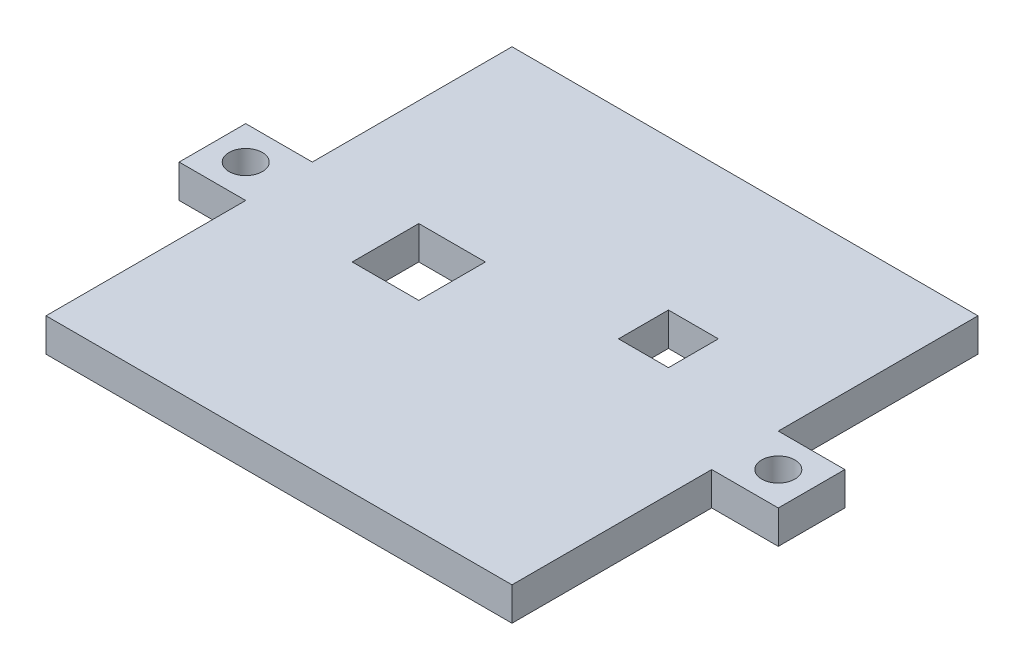
ISO-10303-21;
HEADER;
FILE_DESCRIPTION(('STEP AP214'),'2;1');
FILE_NAME('part.step','',(''),(''),'','','');
FILE_SCHEMA(('AUTOMOTIVE_DESIGN { 1 0 10303 214 1 1 1 1 }'));
ENDSEC;
DATA;
#1=APPLICATION_CONTEXT('core data for automotive mechanical design processes');
#2=APPLICATION_PROTOCOL_DEFINITION('international standard','automotive_design',2000,#1);
#3=PRODUCT_CONTEXT('',#1,'mechanical');
#4=PRODUCT('Part','Part','',(#3));
#5=PRODUCT_RELATED_PRODUCT_CATEGORY('part','',(#4));
#6=PRODUCT_DEFINITION_FORMATION('','',#4);
#7=PRODUCT_DEFINITION_CONTEXT('part definition',#1,'design');
#8=PRODUCT_DEFINITION('design','',#6,#7);
#9=PRODUCT_DEFINITION_SHAPE('','',#8);
#10=(LENGTH_UNIT() NAMED_UNIT(*) SI_UNIT(.MILLI.,.METRE.));
#11=(NAMED_UNIT(*) PLANE_ANGLE_UNIT() SI_UNIT($,.RADIAN.));
#12=(NAMED_UNIT(*) SI_UNIT($,.STERADIAN.) SOLID_ANGLE_UNIT());
#13=UNCERTAINTY_MEASURE_WITH_UNIT(LENGTH_MEASURE(1.E-05),#10,'distance_accuracy_value','');
#14=(GEOMETRIC_REPRESENTATION_CONTEXT(3) GLOBAL_UNCERTAINTY_ASSIGNED_CONTEXT((#13)) GLOBAL_UNIT_ASSIGNED_CONTEXT((#10,
#11,#12)) REPRESENTATION_CONTEXT('',''));
#15=CARTESIAN_POINT('',(0.,0.,0.));
#16=DIRECTION('',(0.,0.,1.));
#17=DIRECTION('',(1.,0.,0.));
#18=AXIS2_PLACEMENT_3D('',#15,#16,#17);
#19=CARTESIAN_POINT('',(-6.35,6.35,6.35));
#20=DIRECTION('',(1.,0.,0.));
#21=DIRECTION('',(0.,0.,-1.));
#22=AXIS2_PLACEMENT_3D('',#19,#20,#21);
#23=PLANE('',#22);
#24=DIRECTION('',(0.,1.,0.));
#25=VECTOR('',#24,1.);
#26=CARTESIAN_POINT('',(-6.34999999999999,0.,-31.75));
#27=LINE('',#26,#25);
#28=CARTESIAN_POINT('',(-6.34999999999999,0.,-31.75));
#29=VERTEX_POINT('',#28);
#30=CARTESIAN_POINT('',(-6.34999999999999,6.35,-31.75));
#31=VERTEX_POINT('',#30);
#32=EDGE_CURVE('E272',#29,#31,#27,.T.);
#33=ORIENTED_EDGE('',*,*,#32,.F.);
#34=DIRECTION('',(0.,0.,1.));
#35=VECTOR('',#34,1.);
#36=CARTESIAN_POINT('',(-6.35,0.,6.35));
#37=LINE('',#36,#35);
#38=CARTESIAN_POINT('',(-6.35,0.,6.35));
#39=VERTEX_POINT('',#38);
#40=EDGE_CURVE('E296',#29,#39,#37,.T.);
#41=ORIENTED_EDGE('',*,*,#40,.T.);
#42=DIRECTION('',(0.,-1.,0.));
#43=VECTOR('',#42,1.);
#44=CARTESIAN_POINT('',(-6.35,6.35,6.35));
#45=LINE('',#44,#43);
#46=CARTESIAN_POINT('',(-6.35,6.35,6.35));
#47=VERTEX_POINT('',#46);
#48=EDGE_CURVE('E11',#47,#39,#45,.T.);
#49=ORIENTED_EDGE('',*,*,#48,.F.);
#50=DIRECTION('',(0.,0.,1.));
#51=VECTOR('',#50,1.);
#52=CARTESIAN_POINT('',(-6.35,6.35,6.35));
#53=LINE('',#52,#51);
#54=EDGE_CURVE('E307',#31,#47,#53,.T.);
#55=ORIENTED_EDGE('',*,*,#54,.F.);
#56=EDGE_LOOP('',(#33,#41,#49,#55));
#57=FACE_BOUND('',#56,.T.);
#58=ADVANCED_FACE('F33',(#57),#23,.F.);
#59=CARTESIAN_POINT('',(82.55,6.35,6.35));
#60=DIRECTION('',(-1.,0.,0.));
#61=DIRECTION('',(0.,0.,1.));
#62=AXIS2_PLACEMENT_3D('',#59,#60,#61);
#63=PLANE('',#62);
#64=DIRECTION('',(0.,1.,0.));
#65=VECTOR('',#64,1.);
#66=CARTESIAN_POINT('',(82.55,0.,-44.45));
#67=LINE('',#66,#65);
#68=CARTESIAN_POINT('',(82.55,0.,-44.45));
#69=VERTEX_POINT('',#68);
#70=CARTESIAN_POINT('',(82.55,6.35,-44.45));
#71=VERTEX_POINT('',#70);
#72=EDGE_CURVE('E294',#69,#71,#67,.T.);
#73=ORIENTED_EDGE('',*,*,#72,.F.);
#74=DIRECTION('',(0.,0.,-1.));
#75=VECTOR('',#74,1.);
#76=CARTESIAN_POINT('',(82.55,0.,6.35));
#77=LINE('',#76,#75);
#78=CARTESIAN_POINT('',(82.55,0.,-82.55));
#79=VERTEX_POINT('',#78);
#80=EDGE_CURVE('E321',#69,#79,#77,.T.);
#81=ORIENTED_EDGE('',*,*,#80,.T.);
#82=DIRECTION('',(0.,-1.,0.));
#83=VECTOR('',#82,1.);
#84=CARTESIAN_POINT('',(82.55,6.35,-82.55));
#85=LINE('',#84,#83);
#86=CARTESIAN_POINT('',(82.55,6.35,-82.55));
#87=VERTEX_POINT('',#86);
#88=EDGE_CURVE('E329',#87,#79,#85,.T.);
#89=ORIENTED_EDGE('',*,*,#88,.F.);
#90=DIRECTION('',(0.,0.,-1.));
#91=VECTOR('',#90,1.);
#92=CARTESIAN_POINT('',(82.55,6.35,6.35));
#93=LINE('',#92,#91);
#94=EDGE_CURVE('E309',#71,#87,#93,.T.);
#95=ORIENTED_EDGE('',*,*,#94,.F.);
#96=EDGE_LOOP('',(#73,#81,#89,#95));
#97=FACE_BOUND('',#96,.T.);
#98=ADVANCED_FACE('F377',(#97),#63,.F.);
#99=CARTESIAN_POINT('',(-6.35,0.,-82.55));
#100=VERTEX_POINT('',#99);
#101=CARTESIAN_POINT('',(-6.34999999999999,0.,-44.45));
#102=VERTEX_POINT('',#101);
#103=EDGE_CURVE('E316',#100,#102,#37,.T.);
#104=ORIENTED_EDGE('',*,*,#103,.T.);
#105=DIRECTION('',(0.,1.,0.));
#106=VECTOR('',#105,1.);
#107=CARTESIAN_POINT('',(-6.34999999999999,0.,-44.45));
#108=LINE('',#107,#106);
#109=CARTESIAN_POINT('',(-6.35,6.35,-44.45));
#110=VERTEX_POINT('',#109);
#111=EDGE_CURVE('E268',#102,#110,#108,.T.);
#112=ORIENTED_EDGE('',*,*,#111,.T.);
#113=CARTESIAN_POINT('',(-6.35,6.35,-82.55));
#114=VERTEX_POINT('',#113);
#115=EDGE_CURVE('E303',#114,#110,#53,.T.);
#116=ORIENTED_EDGE('',*,*,#115,.F.);
#117=DIRECTION('',(0.,-1.,0.));
#118=VECTOR('',#117,1.);
#119=CARTESIAN_POINT('',(-6.35,6.35,-82.55));
#120=LINE('',#119,#118);
#121=EDGE_CURVE('E315',#114,#100,#120,.T.);
#122=ORIENTED_EDGE('',*,*,#121,.T.);
#123=EDGE_LOOP('',(#104,#112,#116,#122));
#124=FACE_BOUND('',#123,.T.);
#125=ADVANCED_FACE('F35',(#124),#23,.F.);
#126=CARTESIAN_POINT('',(-6.35,6.35,6.35));
#127=DIRECTION('',(0.,0.,-1.));
#128=DIRECTION('',(-1.,0.,0.));
#129=AXIS2_PLACEMENT_3D('',#126,#127,#128);
#130=PLANE('',#129);
#131=DIRECTION('',(1.,0.,0.));
#132=VECTOR('',#131,1.);
#133=CARTESIAN_POINT('',(-6.35,0.,6.35));
#134=LINE('',#133,#132);
#135=CARTESIAN_POINT('',(82.55,0.,6.35));
#136=VERTEX_POINT('',#135);
#137=EDGE_CURVE('E319',#39,#136,#134,.T.);
#138=ORIENTED_EDGE('',*,*,#137,.T.);
#139=DIRECTION('',(0.,-1.,0.));
#140=VECTOR('',#139,1.);
#141=CARTESIAN_POINT('',(82.55,6.35,6.35));
#142=LINE('',#141,#140);
#143=CARTESIAN_POINT('',(82.55,6.35,6.35));
#144=VERTEX_POINT('',#143);
#145=EDGE_CURVE('E41',#144,#136,#142,.T.);
#146=ORIENTED_EDGE('',*,*,#145,.F.);
#147=DIRECTION('',(1.,0.,0.));
#148=VECTOR('',#147,1.);
#149=CARTESIAN_POINT('',(-6.35,6.35,6.35));
#150=LINE('',#149,#148);
#151=EDGE_CURVE('E306',#47,#144,#150,.T.);
#152=ORIENTED_EDGE('',*,*,#151,.F.);
#153=ORIENTED_EDGE('',*,*,#48,.T.);
#154=EDGE_LOOP('',(#138,#146,#152,#153));
#155=FACE_BOUND('',#154,.T.);
#156=ADVANCED_FACE('F353',(#155),#130,.F.);
#157=CARTESIAN_POINT('',(82.55,0.,-31.75));
#158=VERTEX_POINT('',#157);
#159=EDGE_CURVE('E322',#136,#158,#77,.T.);
#160=ORIENTED_EDGE('',*,*,#159,.T.);
#161=DIRECTION('',(0.,1.,0.));
#162=VECTOR('',#161,1.);
#163=CARTESIAN_POINT('',(82.55,0.,-31.75));
#164=LINE('',#163,#162);
#165=CARTESIAN_POINT('',(82.55,6.35,-31.75));
#166=VERTEX_POINT('',#165);
#167=EDGE_CURVE('E286',#158,#166,#164,.T.);
#168=ORIENTED_EDGE('',*,*,#167,.T.);
#169=EDGE_CURVE('E310',#144,#166,#93,.T.);
#170=ORIENTED_EDGE('',*,*,#169,.F.);
#171=ORIENTED_EDGE('',*,*,#145,.T.);
#172=EDGE_LOOP('',(#160,#168,#170,#171));
#173=FACE_BOUND('',#172,.T.);
#174=ADVANCED_FACE('F336',(#173),#63,.F.);
#175=CARTESIAN_POINT('',(-6.35,6.35,-82.55));
#176=DIRECTION('',(0.,0.,1.));
#177=DIRECTION('',(1.,0.,0.));
#178=AXIS2_PLACEMENT_3D('',#175,#176,#177);
#179=PLANE('',#178);
#180=DIRECTION('',(-1.,0.,0.));
#181=VECTOR('',#180,1.);
#182=CARTESIAN_POINT('',(-6.35,0.,-82.55));
#183=LINE('',#182,#181);
#184=EDGE_CURVE('E325',#79,#100,#183,.T.);
#185=ORIENTED_EDGE('',*,*,#184,.T.);
#186=ORIENTED_EDGE('',*,*,#121,.F.);
#187=DIRECTION('',(-1.,0.,0.));
#188=VECTOR('',#187,1.);
#189=CARTESIAN_POINT('',(-6.35,6.35,-82.55));
#190=LINE('',#189,#188);
#191=EDGE_CURVE('E313',#87,#114,#190,.T.);
#192=ORIENTED_EDGE('',*,*,#191,.F.);
#193=ORIENTED_EDGE('',*,*,#88,.T.);
#194=EDGE_LOOP('',(#185,#186,#192,#193));
#195=FACE_BOUND('',#194,.T.);
#196=ADVANCED_FACE('F372',(#195),#179,.F.);
#197=CARTESIAN_POINT('',(0.,6.35,0.));
#198=DIRECTION('',(0.,-1.,0.));
#199=DIRECTION('',(0.,0.,-1.));
#200=AXIS2_PLACEMENT_3D('',#197,#198,#199);
#201=PLANE('',#200);
#202=DIRECTION('',(1.,0.,0.));
#203=VECTOR('',#202,1.);
#204=CARTESIAN_POINT('',(52.07,6.35,-44.45));
#205=LINE('',#204,#203);
#206=CARTESIAN_POINT('',(52.07,6.35,-44.45));
#207=VERTEX_POINT('',#206);
#208=CARTESIAN_POINT('',(61.595,6.35,-44.45));
#209=VERTEX_POINT('',#208);
#210=EDGE_CURVE('E197',#207,#209,#205,.T.);
#211=ORIENTED_EDGE('',*,*,#210,.F.);
#212=DIRECTION('',(0.,0.,1.));
#213=VECTOR('',#212,1.);
#214=CARTESIAN_POINT('',(52.07,6.35,-53.975));
#215=LINE('',#214,#213);
#216=CARTESIAN_POINT('',(52.07,6.35,-53.975));
#217=VERTEX_POINT('',#216);
#218=EDGE_CURVE('E48',#217,#207,#215,.T.);
#219=ORIENTED_EDGE('',*,*,#218,.F.);
#220=DIRECTION('',(-1.,0.,0.));
#221=VECTOR('',#220,1.);
#222=CARTESIAN_POINT('',(52.07,6.35,-53.975));
#223=LINE('',#222,#221);
#224=CARTESIAN_POINT('',(61.595,6.35,-53.975));
#225=VERTEX_POINT('',#224);
#226=EDGE_CURVE('E188',#225,#217,#223,.T.);
#227=ORIENTED_EDGE('',*,*,#226,.F.);
#228=DIRECTION('',(0.,0.,-1.));
#229=VECTOR('',#228,1.);
#230=CARTESIAN_POINT('',(61.595,6.35,-53.975));
#231=LINE('',#230,#229);
#232=EDGE_CURVE('E191',#209,#225,#231,.T.);
#233=ORIENTED_EDGE('',*,*,#232,.F.);
#234=EDGE_LOOP('',(#211,#219,#227,#233));
#235=FACE_BOUND('',#234,.T.);
#236=DIRECTION('',(1.,0.,0.));
#237=VECTOR('',#236,1.);
#238=CARTESIAN_POINT('',(13.97,6.35,-31.75));
#239=LINE('',#238,#237);
#240=CARTESIAN_POINT('',(13.97,6.35,-31.75));
#241=VERTEX_POINT('',#240);
#242=CARTESIAN_POINT('',(26.67,6.35,-31.75));
#243=VERTEX_POINT('',#242);
#244=EDGE_CURVE('E222',#241,#243,#239,.T.);
#245=ORIENTED_EDGE('',*,*,#244,.F.);
#246=DIRECTION('',(0.,0.,1.));
#247=VECTOR('',#246,1.);
#248=CARTESIAN_POINT('',(13.97,6.35,-44.45));
#249=LINE('',#248,#247);
#250=CARTESIAN_POINT('',(13.97,6.35,-44.45));
#251=VERTEX_POINT('',#250);
#252=EDGE_CURVE('E203',#251,#241,#249,.T.);
#253=ORIENTED_EDGE('',*,*,#252,.F.);
#254=DIRECTION('',(-1.,0.,0.));
#255=VECTOR('',#254,1.);
#256=CARTESIAN_POINT('',(13.97,6.35,-44.45));
#257=LINE('',#256,#255);
#258=CARTESIAN_POINT('',(26.67,6.35,-44.45));
#259=VERTEX_POINT('',#258);
#260=EDGE_CURVE('E211',#259,#251,#257,.T.);
#261=ORIENTED_EDGE('',*,*,#260,.F.);
#262=DIRECTION('',(0.,0.,-1.));
#263=VECTOR('',#262,1.);
#264=CARTESIAN_POINT('',(26.67,6.35,-44.45));
#265=LINE('',#264,#263);
#266=EDGE_CURVE('E225',#243,#259,#265,.T.);
#267=ORIENTED_EDGE('',*,*,#266,.F.);
#268=EDGE_LOOP('',(#245,#253,#261,#267));
#269=FACE_BOUND('',#268,.T.);
#270=CARTESIAN_POINT('',(-12.7,6.35,-38.1));
#271=DIRECTION('',(0.,1.,0.));
#272=DIRECTION('',(0.,0.,-1.));
#273=AXIS2_PLACEMENT_3D('',#270,#271,#272);
#274=CIRCLE('',#273,3.175);
#275=CARTESIAN_POINT('',(-12.7,6.35,-41.275));
#276=VERTEX_POINT('',#275);
#277=EDGE_CURVE('E232',#276,#276,#274,.T.);
#278=ORIENTED_EDGE('',*,*,#277,.F.);
#279=EDGE_LOOP('',(#278));
#280=FACE_BOUND('',#279,.T.);
#281=CARTESIAN_POINT('',(88.9,6.35,-38.1));
#282=DIRECTION('',(0.,1.,0.));
#283=DIRECTION('',(0.,0.,1.));
#284=AXIS2_PLACEMENT_3D('',#281,#282,#283);
#285=CIRCLE('',#284,3.175);
#286=CARTESIAN_POINT('',(88.9,6.35,-34.925));
#287=VERTEX_POINT('',#286);
#288=EDGE_CURVE('E242',#287,#287,#285,.T.);
#289=ORIENTED_EDGE('',*,*,#288,.F.);
#290=EDGE_LOOP('',(#289));
#291=FACE_BOUND('',#290,.T.);
#292=ORIENTED_EDGE('',*,*,#115,.T.);
#293=DIRECTION('',(-1.,0.,0.));
#294=VECTOR('',#293,1.);
#295=CARTESIAN_POINT('',(-6.34999999999999,6.35,-44.45));
#296=LINE('',#295,#294);
#297=CARTESIAN_POINT('',(-19.05,6.35,-44.45));
#298=VERTEX_POINT('',#297);
#299=EDGE_CURVE('E248',#110,#298,#296,.T.);
#300=ORIENTED_EDGE('',*,*,#299,.T.);
#301=DIRECTION('',(0.,0.,1.));
#302=VECTOR('',#301,1.);
#303=CARTESIAN_POINT('',(-19.05,6.35,-44.45));
#304=LINE('',#303,#302);
#305=CARTESIAN_POINT('',(-19.05,6.35,-31.75));
#306=VERTEX_POINT('',#305);
#307=EDGE_CURVE('E263',#298,#306,#304,.T.);
#308=ORIENTED_EDGE('',*,*,#307,.T.);
#309=DIRECTION('',(1.,0.,0.));
#310=VECTOR('',#309,1.);
#311=CARTESIAN_POINT('',(-6.34999999999999,6.35,-31.75));
#312=LINE('',#311,#310);
#313=EDGE_CURVE('E255',#306,#31,#312,.T.);
#314=ORIENTED_EDGE('',*,*,#313,.T.);
#315=ORIENTED_EDGE('',*,*,#54,.T.);
#316=ORIENTED_EDGE('',*,*,#151,.T.);
#317=ORIENTED_EDGE('',*,*,#169,.T.);
#318=DIRECTION('',(1.,0.,0.));
#319=VECTOR('',#318,1.);
#320=CARTESIAN_POINT('',(82.55,6.35,-31.75));
#321=LINE('',#320,#319);
#322=CARTESIAN_POINT('',(95.25,6.35,-31.75));
#323=VERTEX_POINT('',#322);
#324=EDGE_CURVE('E271',#166,#323,#321,.T.);
#325=ORIENTED_EDGE('',*,*,#324,.T.);
#326=DIRECTION('',(0.,0.,-1.));
#327=VECTOR('',#326,1.);
#328=CARTESIAN_POINT('',(95.25,6.35,-44.45));
#329=LINE('',#328,#327);
#330=CARTESIAN_POINT('',(95.25,6.35,-44.45));
#331=VERTEX_POINT('',#330);
#332=EDGE_CURVE('E289',#323,#331,#329,.T.);
#333=ORIENTED_EDGE('',*,*,#332,.T.);
#334=DIRECTION('',(-1.,0.,0.));
#335=VECTOR('',#334,1.);
#336=CARTESIAN_POINT('',(82.55,6.35,-44.45));
#337=LINE('',#336,#335);
#338=EDGE_CURVE('E281',#331,#71,#337,.T.);
#339=ORIENTED_EDGE('',*,*,#338,.T.);
#340=ORIENTED_EDGE('',*,*,#94,.T.);
#341=ORIENTED_EDGE('',*,*,#191,.T.);
#342=EDGE_LOOP('',(#292,#300,#308,#314,#315,#316,#317,#325,#333,#339,#340,#341));
#343=FACE_BOUND('',#342,.T.);
#344=ADVANCED_FACE('F350',(#235,#269,#280,#291,#343),#201,.F.);
#345=CARTESIAN_POINT('',(0.,0.,0.));
#346=DIRECTION('',(0.,-1.,0.));
#347=DIRECTION('',(0.,0.,-1.));
#348=AXIS2_PLACEMENT_3D('',#345,#346,#347);
#349=PLANE('',#348);
#350=DIRECTION('',(0.,0.,1.));
#351=VECTOR('',#350,1.);
#352=CARTESIAN_POINT('',(52.07,0.,-53.975));
#353=LINE('',#352,#351);
#354=CARTESIAN_POINT('',(52.07,0.,-53.975));
#355=VERTEX_POINT('',#354);
#356=CARTESIAN_POINT('',(52.07,0.,-44.45));
#357=VERTEX_POINT('',#356);
#358=EDGE_CURVE('E172',#355,#357,#353,.T.);
#359=ORIENTED_EDGE('',*,*,#358,.T.);
#360=DIRECTION('',(1.,0.,0.));
#361=VECTOR('',#360,1.);
#362=CARTESIAN_POINT('',(52.07,0.,-44.45));
#363=LINE('',#362,#361);
#364=CARTESIAN_POINT('',(61.595,0.,-44.45));
#365=VERTEX_POINT('',#364);
#366=EDGE_CURVE('E181',#357,#365,#363,.T.);
#367=ORIENTED_EDGE('',*,*,#366,.T.);
#368=DIRECTION('',(0.,0.,-1.));
#369=VECTOR('',#368,1.);
#370=CARTESIAN_POINT('',(61.595,0.,-53.975));
#371=LINE('',#370,#369);
#372=CARTESIAN_POINT('',(61.595,0.,-53.975));
#373=VERTEX_POINT('',#372);
#374=EDGE_CURVE('E56',#365,#373,#371,.T.);
#375=ORIENTED_EDGE('',*,*,#374,.T.);
#376=DIRECTION('',(-1.,0.,0.));
#377=VECTOR('',#376,1.);
#378=CARTESIAN_POINT('',(52.07,0.,-53.975));
#379=LINE('',#378,#377);
#380=EDGE_CURVE('E178',#373,#355,#379,.T.);
#381=ORIENTED_EDGE('',*,*,#380,.T.);
#382=EDGE_LOOP('',(#359,#367,#375,#381));
#383=FACE_BOUND('',#382,.T.);
#384=DIRECTION('',(0.,0.,1.));
#385=VECTOR('',#384,1.);
#386=CARTESIAN_POINT('',(13.97,0.,-44.45));
#387=LINE('',#386,#385);
#388=CARTESIAN_POINT('',(13.97,0.,-44.45));
#389=VERTEX_POINT('',#388);
#390=CARTESIAN_POINT('',(13.97,0.,-31.75));
#391=VERTEX_POINT('',#390);
#392=EDGE_CURVE('E207',#389,#391,#387,.T.);
#393=ORIENTED_EDGE('',*,*,#392,.T.);
#394=DIRECTION('',(1.,0.,0.));
#395=VECTOR('',#394,1.);
#396=CARTESIAN_POINT('',(13.97,0.,-31.75));
#397=LINE('',#396,#395);
#398=CARTESIAN_POINT('',(26.67,0.,-31.75));
#399=VERTEX_POINT('',#398);
#400=EDGE_CURVE('E210',#391,#399,#397,.T.);
#401=ORIENTED_EDGE('',*,*,#400,.T.);
#402=DIRECTION('',(0.,0.,-1.));
#403=VECTOR('',#402,1.);
#404=CARTESIAN_POINT('',(26.67,0.,-44.45));
#405=LINE('',#404,#403);
#406=CARTESIAN_POINT('',(26.67,0.,-44.45));
#407=VERTEX_POINT('',#406);
#408=EDGE_CURVE('E214',#399,#407,#405,.T.);
#409=ORIENTED_EDGE('',*,*,#408,.T.);
#410=DIRECTION('',(-1.,0.,0.));
#411=VECTOR('',#410,1.);
#412=CARTESIAN_POINT('',(13.97,0.,-44.45));
#413=LINE('',#412,#411);
#414=EDGE_CURVE('E217',#407,#389,#413,.T.);
#415=ORIENTED_EDGE('',*,*,#414,.T.);
#416=EDGE_LOOP('',(#393,#401,#409,#415));
#417=FACE_BOUND('',#416,.T.);
#418=CARTESIAN_POINT('',(-12.7,0.,-38.1));
#419=DIRECTION('',(0.,1.,0.));
#420=DIRECTION('',(0.,0.,-1.));
#421=AXIS2_PLACEMENT_3D('',#418,#419,#420);
#422=CIRCLE('',#421,3.175);
#423=CARTESIAN_POINT('',(-12.7,0.,-41.275));
#424=VERTEX_POINT('',#423);
#425=EDGE_CURVE('E239',#424,#424,#422,.T.);
#426=ORIENTED_EDGE('',*,*,#425,.T.);
#427=EDGE_LOOP('',(#426));
#428=FACE_BOUND('',#427,.T.);
#429=CARTESIAN_POINT('',(88.9,0.,-38.1));
#430=DIRECTION('',(0.,1.,0.));
#431=DIRECTION('',(0.,0.,1.));
#432=AXIS2_PLACEMENT_3D('',#429,#430,#431);
#433=CIRCLE('',#432,3.175);
#434=CARTESIAN_POINT('',(88.9,0.,-34.925));
#435=VERTEX_POINT('',#434);
#436=EDGE_CURVE('E245',#435,#435,#433,.T.);
#437=ORIENTED_EDGE('',*,*,#436,.T.);
#438=EDGE_LOOP('',(#437));
#439=FACE_BOUND('',#438,.T.);
#440=ORIENTED_EDGE('',*,*,#103,.F.);
#441=ORIENTED_EDGE('',*,*,#184,.F.);
#442=ORIENTED_EDGE('',*,*,#80,.F.);
#443=DIRECTION('',(-1.,0.,0.));
#444=VECTOR('',#443,1.);
#445=CARTESIAN_POINT('',(82.55,0.,-44.45));
#446=LINE('',#445,#444);
#447=CARTESIAN_POINT('',(95.25,0.,-44.45));
#448=VERTEX_POINT('',#447);
#449=EDGE_CURVE('E284',#448,#69,#446,.T.);
#450=ORIENTED_EDGE('',*,*,#449,.F.);
#451=DIRECTION('',(0.,0.,-1.));
#452=VECTOR('',#451,1.);
#453=CARTESIAN_POINT('',(95.25,0.,-44.45));
#454=LINE('',#453,#452);
#455=CARTESIAN_POINT('',(95.25,0.,-31.75));
#456=VERTEX_POINT('',#455);
#457=EDGE_CURVE('E280',#456,#448,#454,.T.);
#458=ORIENTED_EDGE('',*,*,#457,.F.);
#459=DIRECTION('',(1.,0.,0.));
#460=VECTOR('',#459,1.);
#461=CARTESIAN_POINT('',(82.55,0.,-31.75));
#462=LINE('',#461,#460);
#463=EDGE_CURVE('E277',#158,#456,#462,.T.);
#464=ORIENTED_EDGE('',*,*,#463,.F.);
#465=ORIENTED_EDGE('',*,*,#159,.F.);
#466=ORIENTED_EDGE('',*,*,#137,.F.);
#467=ORIENTED_EDGE('',*,*,#40,.F.);
#468=DIRECTION('',(1.,0.,0.));
#469=VECTOR('',#468,1.);
#470=CARTESIAN_POINT('',(-6.34999999999999,0.,-31.75));
#471=LINE('',#470,#469);
#472=CARTESIAN_POINT('',(-19.05,0.,-31.75));
#473=VERTEX_POINT('',#472);
#474=EDGE_CURVE('E258',#473,#29,#471,.T.);
#475=ORIENTED_EDGE('',*,*,#474,.F.);
#476=DIRECTION('',(0.,0.,1.));
#477=VECTOR('',#476,1.);
#478=CARTESIAN_POINT('',(-19.05,0.,-44.45));
#479=LINE('',#478,#477);
#480=CARTESIAN_POINT('',(-19.05,0.,-44.45));
#481=VERTEX_POINT('',#480);
#482=EDGE_CURVE('E254',#481,#473,#479,.T.);
#483=ORIENTED_EDGE('',*,*,#482,.F.);
#484=DIRECTION('',(-1.,0.,0.));
#485=VECTOR('',#484,1.);
#486=CARTESIAN_POINT('',(-6.34999999999999,0.,-44.45));
#487=LINE('',#486,#485);
#488=EDGE_CURVE('E251',#102,#481,#487,.T.);
#489=ORIENTED_EDGE('',*,*,#488,.F.);
#490=EDGE_LOOP('',(#440,#441,#442,#450,#458,#464,#465,#466,#467,#475,#483,#489));
#491=FACE_BOUND('',#490,.T.);
#492=ADVANCED_FACE('F185',(#383,#417,#428,#439,#491),#349,.T.);
#493=CARTESIAN_POINT('',(82.55,0.,-44.45));
#494=DIRECTION('',(0.,0.,-1.));
#495=DIRECTION('',(-1.,0.,0.));
#496=AXIS2_PLACEMENT_3D('',#493,#494,#495);
#497=PLANE('',#496);
#498=ORIENTED_EDGE('',*,*,#338,.F.);
#499=DIRECTION('',(0.,1.,0.));
#500=VECTOR('',#499,1.);
#501=CARTESIAN_POINT('',(95.25,0.,-44.45));
#502=LINE('',#501,#500);
#503=EDGE_CURVE('E297',#448,#331,#502,.T.);
#504=ORIENTED_EDGE('',*,*,#503,.F.);
#505=ORIENTED_EDGE('',*,*,#449,.T.);
#506=ORIENTED_EDGE('',*,*,#72,.T.);
#507=EDGE_LOOP('',(#498,#504,#505,#506));
#508=FACE_BOUND('',#507,.T.);
#509=ADVANCED_FACE('F381',(#508),#497,.T.);
#510=CARTESIAN_POINT('',(95.25,0.,-44.45));
#511=DIRECTION('',(1.,0.,0.));
#512=DIRECTION('',(0.,0.,-1.));
#513=AXIS2_PLACEMENT_3D('',#510,#511,#512);
#514=PLANE('',#513);
#515=ORIENTED_EDGE('',*,*,#332,.F.);
#516=DIRECTION('',(0.,1.,0.));
#517=VECTOR('',#516,1.);
#518=CARTESIAN_POINT('',(95.25,0.,-31.75));
#519=LINE('',#518,#517);
#520=EDGE_CURVE('E299',#456,#323,#519,.T.);
#521=ORIENTED_EDGE('',*,*,#520,.F.);
#522=ORIENTED_EDGE('',*,*,#457,.T.);
#523=ORIENTED_EDGE('',*,*,#503,.T.);
#524=EDGE_LOOP('',(#515,#521,#522,#523));
#525=FACE_BOUND('',#524,.T.);
#526=ADVANCED_FACE('F383',(#525),#514,.T.);
#527=CARTESIAN_POINT('',(82.55,0.,-31.75));
#528=DIRECTION('',(0.,0.,1.));
#529=DIRECTION('',(1.,0.,0.));
#530=AXIS2_PLACEMENT_3D('',#527,#528,#529);
#531=PLANE('',#530);
#532=ORIENTED_EDGE('',*,*,#324,.F.);
#533=ORIENTED_EDGE('',*,*,#167,.F.);
#534=ORIENTED_EDGE('',*,*,#463,.T.);
#535=ORIENTED_EDGE('',*,*,#520,.T.);
#536=EDGE_LOOP('',(#532,#533,#534,#535));
#537=FACE_BOUND('',#536,.T.);
#538=ADVANCED_FACE('F347',(#537),#531,.T.);
#539=CARTESIAN_POINT('',(-6.34999999999999,0.,-44.45));
#540=DIRECTION('',(0.,0.,-1.));
#541=DIRECTION('',(-1.,0.,0.));
#542=AXIS2_PLACEMENT_3D('',#539,#540,#541);
#543=PLANE('',#542);
#544=ORIENTED_EDGE('',*,*,#299,.F.);
#545=ORIENTED_EDGE('',*,*,#111,.F.);
#546=ORIENTED_EDGE('',*,*,#488,.T.);
#547=DIRECTION('',(0.,1.,0.));
#548=VECTOR('',#547,1.);
#549=CARTESIAN_POINT('',(-19.05,0.,-44.45));
#550=LINE('',#549,#548);
#551=EDGE_CURVE('E260',#481,#298,#550,.T.);
#552=ORIENTED_EDGE('',*,*,#551,.T.);
#553=EDGE_LOOP('',(#544,#545,#546,#552));
#554=FACE_BOUND('',#553,.T.);
#555=ADVANCED_FACE('F365',(#554),#543,.T.);
#556=CARTESIAN_POINT('',(-6.34999999999999,0.,-31.75));
#557=DIRECTION('',(0.,0.,1.));
#558=DIRECTION('',(1.,0.,0.));
#559=AXIS2_PLACEMENT_3D('',#556,#557,#558);
#560=PLANE('',#559);
#561=ORIENTED_EDGE('',*,*,#313,.F.);
#562=DIRECTION('',(0.,1.,0.));
#563=VECTOR('',#562,1.);
#564=CARTESIAN_POINT('',(-19.05,0.,-31.75));
#565=LINE('',#564,#563);
#566=EDGE_CURVE('E274',#473,#306,#565,.T.);
#567=ORIENTED_EDGE('',*,*,#566,.F.);
#568=ORIENTED_EDGE('',*,*,#474,.T.);
#569=ORIENTED_EDGE('',*,*,#32,.T.);
#570=EDGE_LOOP('',(#561,#567,#568,#569));
#571=FACE_BOUND('',#570,.T.);
#572=ADVANCED_FACE('F435',(#571),#560,.T.);
#573=CARTESIAN_POINT('',(-19.05,0.,-44.45));
#574=DIRECTION('',(-1.,0.,0.));
#575=DIRECTION('',(0.,0.,1.));
#576=AXIS2_PLACEMENT_3D('',#573,#574,#575);
#577=PLANE('',#576);
#578=ORIENTED_EDGE('',*,*,#307,.F.);
#579=ORIENTED_EDGE('',*,*,#551,.F.);
#580=ORIENTED_EDGE('',*,*,#482,.T.);
#581=ORIENTED_EDGE('',*,*,#566,.T.);
#582=EDGE_LOOP('',(#578,#579,#580,#581));
#583=FACE_BOUND('',#582,.T.);
#584=ADVANCED_FACE('F362',(#583),#577,.T.);
#585=CARTESIAN_POINT('',(88.9,0.,-38.1));
#586=DIRECTION('',(0.,1.,0.));
#587=DIRECTION('',(0.,0.,1.));
#588=AXIS2_PLACEMENT_3D('',#585,#586,#587);
#589=CYLINDRICAL_SURFACE('',#588,3.175);
#590=ORIENTED_EDGE('',*,*,#436,.F.);
#591=EDGE_LOOP('',(#590));
#592=FACE_BOUND('',#591,.T.);
#593=ORIENTED_EDGE('',*,*,#288,.T.);
#594=EDGE_LOOP('',(#593));
#595=FACE_BOUND('',#594,.T.);
#596=ADVANCED_FACE('F423',(#592,#595),#589,.F.);
#597=CARTESIAN_POINT('',(-12.7,0.,-38.1));
#598=DIRECTION('',(0.,1.,0.));
#599=DIRECTION('',(0.,0.,1.));
#600=AXIS2_PLACEMENT_3D('',#597,#598,#599);
#601=CYLINDRICAL_SURFACE('',#600,3.175);
#602=ORIENTED_EDGE('',*,*,#425,.F.);
#603=EDGE_LOOP('',(#602));
#604=FACE_BOUND('',#603,.T.);
#605=ORIENTED_EDGE('',*,*,#277,.T.);
#606=EDGE_LOOP('',(#605));
#607=FACE_BOUND('',#606,.T.);
#608=ADVANCED_FACE('F425',(#604,#607),#601,.F.);
#609=CARTESIAN_POINT('',(13.97,0.,-44.45));
#610=DIRECTION('',(-1.,0.,0.));
#611=DIRECTION('',(0.,0.,1.));
#612=AXIS2_PLACEMENT_3D('',#609,#610,#611);
#613=PLANE('',#612);
#614=ORIENTED_EDGE('',*,*,#252,.T.);
#615=DIRECTION('',(0.,1.,0.));
#616=VECTOR('',#615,1.);
#617=CARTESIAN_POINT('',(13.97,0.,-31.75));
#618=LINE('',#617,#616);
#619=EDGE_CURVE('E220',#391,#241,#618,.T.);
#620=ORIENTED_EDGE('',*,*,#619,.F.);
#621=ORIENTED_EDGE('',*,*,#392,.F.);
#622=DIRECTION('',(0.,1.,0.));
#623=VECTOR('',#622,1.);
#624=CARTESIAN_POINT('',(13.97,0.,-44.45));
#625=LINE('',#624,#623);
#626=EDGE_CURVE('E230',#389,#251,#625,.T.);
#627=ORIENTED_EDGE('',*,*,#626,.T.);
#628=EDGE_LOOP('',(#614,#620,#621,#627));
#629=FACE_BOUND('',#628,.T.);
#630=ADVANCED_FACE('F432',(#629),#613,.F.);
#631=CARTESIAN_POINT('',(13.97,0.,-44.45));
#632=DIRECTION('',(0.,0.,-1.));
#633=DIRECTION('',(-1.,0.,0.));
#634=AXIS2_PLACEMENT_3D('',#631,#632,#633);
#635=PLANE('',#634);
#636=ORIENTED_EDGE('',*,*,#260,.T.);
#637=ORIENTED_EDGE('',*,*,#626,.F.);
#638=ORIENTED_EDGE('',*,*,#414,.F.);
#639=DIRECTION('',(0.,1.,0.));
#640=VECTOR('',#639,1.);
#641=CARTESIAN_POINT('',(26.67,0.,-44.45));
#642=LINE('',#641,#640);
#643=EDGE_CURVE('E233',#407,#259,#642,.T.);
#644=ORIENTED_EDGE('',*,*,#643,.T.);
#645=EDGE_LOOP('',(#636,#637,#638,#644));
#646=FACE_BOUND('',#645,.T.);
#647=ADVANCED_FACE('F487',(#646),#635,.F.);
#648=CARTESIAN_POINT('',(26.67,0.,-44.45));
#649=DIRECTION('',(1.,0.,0.));
#650=DIRECTION('',(0.,0.,-1.));
#651=AXIS2_PLACEMENT_3D('',#648,#649,#650);
#652=PLANE('',#651);
#653=ORIENTED_EDGE('',*,*,#266,.T.);
#654=ORIENTED_EDGE('',*,*,#643,.F.);
#655=ORIENTED_EDGE('',*,*,#408,.F.);
#656=DIRECTION('',(0.,1.,0.));
#657=VECTOR('',#656,1.);
#658=CARTESIAN_POINT('',(26.67,0.,-31.75));
#659=LINE('',#658,#657);
#660=EDGE_CURVE('E235',#399,#243,#659,.T.);
#661=ORIENTED_EDGE('',*,*,#660,.T.);
#662=EDGE_LOOP('',(#653,#654,#655,#661));
#663=FACE_BOUND('',#662,.T.);
#664=ADVANCED_FACE('F496',(#663),#652,.F.);
#665=CARTESIAN_POINT('',(13.97,0.,-31.75));
#666=DIRECTION('',(0.,0.,1.));
#667=DIRECTION('',(1.,0.,0.));
#668=AXIS2_PLACEMENT_3D('',#665,#666,#667);
#669=PLANE('',#668);
#670=ORIENTED_EDGE('',*,*,#244,.T.);
#671=ORIENTED_EDGE('',*,*,#660,.F.);
#672=ORIENTED_EDGE('',*,*,#400,.F.);
#673=ORIENTED_EDGE('',*,*,#619,.T.);
#674=EDGE_LOOP('',(#670,#671,#672,#673));
#675=FACE_BOUND('',#674,.T.);
#676=ADVANCED_FACE('F506',(#675),#669,.F.);
#677=CARTESIAN_POINT('',(52.07,0.,-53.975));
#678=DIRECTION('',(-1.,0.,0.));
#679=DIRECTION('',(0.,0.,1.));
#680=AXIS2_PLACEMENT_3D('',#677,#678,#679);
#681=PLANE('',#680);
#682=ORIENTED_EDGE('',*,*,#218,.T.);
#683=DIRECTION('',(0.,1.,0.));
#684=VECTOR('',#683,1.);
#685=CARTESIAN_POINT('',(52.07,0.,-44.45));
#686=LINE('',#685,#684);
#687=EDGE_CURVE('E168',#357,#207,#686,.T.);
#688=ORIENTED_EDGE('',*,*,#687,.F.);
#689=ORIENTED_EDGE('',*,*,#358,.F.);
#690=DIRECTION('',(0.,1.,0.));
#691=VECTOR('',#690,1.);
#692=CARTESIAN_POINT('',(52.07,0.,-53.975));
#693=LINE('',#692,#691);
#694=EDGE_CURVE('E201',#355,#217,#693,.T.);
#695=ORIENTED_EDGE('',*,*,#694,.T.);
#696=EDGE_LOOP('',(#682,#688,#689,#695));
#697=FACE_BOUND('',#696,.T.);
#698=ADVANCED_FACE('F170',(#697),#681,.F.);
#699=CARTESIAN_POINT('',(52.07,0.,-53.975));
#700=DIRECTION('',(0.,0.,-1.));
#701=DIRECTION('',(-1.,0.,0.));
#702=AXIS2_PLACEMENT_3D('',#699,#700,#701);
#703=PLANE('',#702);
#704=ORIENTED_EDGE('',*,*,#226,.T.);
#705=ORIENTED_EDGE('',*,*,#694,.F.);
#706=ORIENTED_EDGE('',*,*,#380,.F.);
#707=DIRECTION('',(0.,1.,0.));
#708=VECTOR('',#707,1.);
#709=CARTESIAN_POINT('',(61.595,0.,-53.975));
#710=LINE('',#709,#708);
#711=EDGE_CURVE('E204',#373,#225,#710,.T.);
#712=ORIENTED_EDGE('',*,*,#711,.T.);
#713=EDGE_LOOP('',(#704,#705,#706,#712));
#714=FACE_BOUND('',#713,.T.);
#715=ADVANCED_FACE('F525',(#714),#703,.F.);
#716=CARTESIAN_POINT('',(61.595,0.,-53.975));
#717=DIRECTION('',(1.,0.,0.));
#718=DIRECTION('',(0.,0.,-1.));
#719=AXIS2_PLACEMENT_3D('',#716,#717,#718);
#720=PLANE('',#719);
#721=ORIENTED_EDGE('',*,*,#232,.T.);
#722=ORIENTED_EDGE('',*,*,#711,.F.);
#723=ORIENTED_EDGE('',*,*,#374,.F.);
#724=DIRECTION('',(0.,1.,0.));
#725=VECTOR('',#724,1.);
#726=CARTESIAN_POINT('',(61.595,0.,-44.45));
#727=LINE('',#726,#725);
#728=EDGE_CURVE('E177',#365,#209,#727,.T.);
#729=ORIENTED_EDGE('',*,*,#728,.T.);
#730=EDGE_LOOP('',(#721,#722,#723,#729));
#731=FACE_BOUND('',#730,.T.);
#732=ADVANCED_FACE('F534',(#731),#720,.F.);
#733=CARTESIAN_POINT('',(52.07,0.,-44.45));
#734=DIRECTION('',(0.,0.,1.));
#735=DIRECTION('',(1.,0.,0.));
#736=AXIS2_PLACEMENT_3D('',#733,#734,#735);
#737=PLANE('',#736);
#738=ORIENTED_EDGE('',*,*,#210,.T.);
#739=ORIENTED_EDGE('',*,*,#728,.F.);
#740=ORIENTED_EDGE('',*,*,#366,.F.);
#741=ORIENTED_EDGE('',*,*,#687,.T.);
#742=EDGE_LOOP('',(#738,#739,#740,#741));
#743=FACE_BOUND('',#742,.T.);
#744=ADVANCED_FACE('F182',(#743),#737,.F.);
#745=CLOSED_SHELL('',(#58,#98,#125,#156,#174,#196,#344,#492,#509,#526,#538,#555,#572,#584,#596,
#608,#630,#647,#664,#676,#698,#715,#732,#744));
#746=MANIFOLD_SOLID_BREP('B2',#745);
#747=ADVANCED_BREP_SHAPE_REPRESENTATION('',(#18,#746),#14);
#748=SHAPE_DEFINITION_REPRESENTATION(#9,#747);
ENDSEC;
END-ISO-10303-21;
